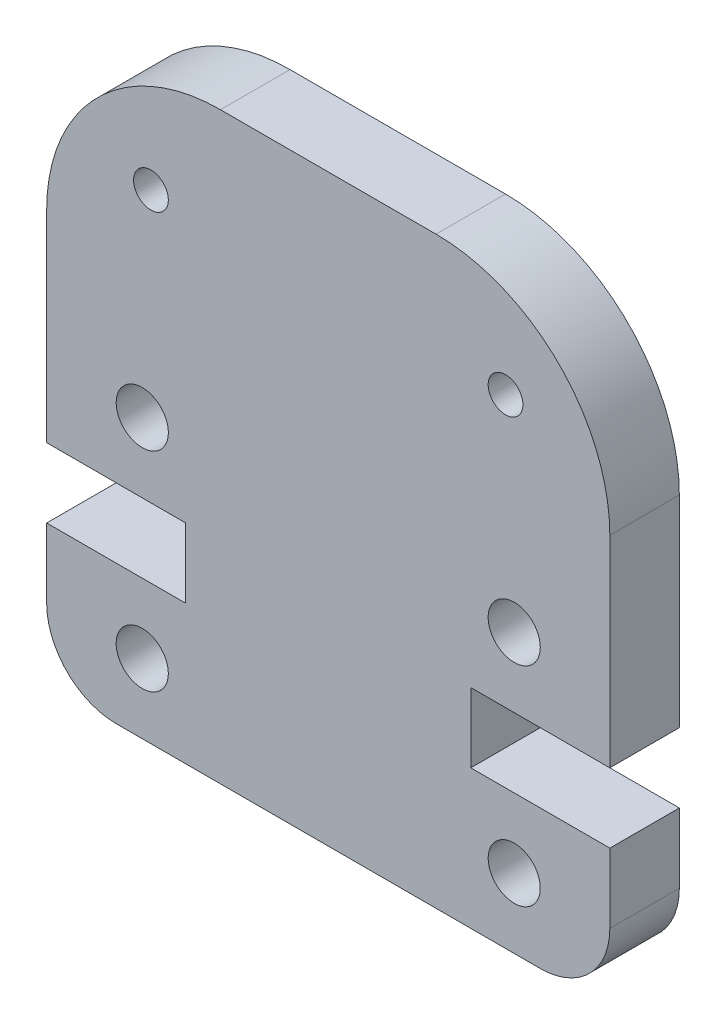
ISO-10303-21;
HEADER;
FILE_DESCRIPTION(('STEP AP214'),'2;1');
FILE_NAME('part.step','',(''),(''),'','','');
FILE_SCHEMA(('AUTOMOTIVE_DESIGN { 1 0 10303 214 1 1 1 1 }'));
ENDSEC;
DATA;
#1=APPLICATION_CONTEXT('core data for automotive mechanical design processes');
#2=APPLICATION_PROTOCOL_DEFINITION('international standard','automotive_design',2000,#1);
#3=PRODUCT_CONTEXT('',#1,'mechanical');
#4=PRODUCT('Part','Part','',(#3));
#5=PRODUCT_RELATED_PRODUCT_CATEGORY('part','',(#4));
#6=PRODUCT_DEFINITION_FORMATION('','',#4);
#7=PRODUCT_DEFINITION_CONTEXT('part definition',#1,'design');
#8=PRODUCT_DEFINITION('design','',#6,#7);
#9=PRODUCT_DEFINITION_SHAPE('','',#8);
#10=(LENGTH_UNIT() NAMED_UNIT(*) SI_UNIT(.MILLI.,.METRE.));
#11=(NAMED_UNIT(*) PLANE_ANGLE_UNIT() SI_UNIT($,.RADIAN.));
#12=(NAMED_UNIT(*) SI_UNIT($,.STERADIAN.) SOLID_ANGLE_UNIT());
#13=UNCERTAINTY_MEASURE_WITH_UNIT(LENGTH_MEASURE(1.E-05),#10,'distance_accuracy_value','');
#14=(GEOMETRIC_REPRESENTATION_CONTEXT(3) GLOBAL_UNCERTAINTY_ASSIGNED_CONTEXT((#13)) GLOBAL_UNIT_ASSIGNED_CONTEXT((#10,
#11,#12)) REPRESENTATION_CONTEXT('',''));
#15=CARTESIAN_POINT('',(0.,0.,0.));
#16=DIRECTION('',(0.,0.,1.));
#17=DIRECTION('',(1.,0.,0.));
#18=AXIS2_PLACEMENT_3D('',#15,#16,#17);
#19=CARTESIAN_POINT('',(5.,11.795,2.));
#20=DIRECTION('',(0.,0.,1.));
#21=DIRECTION('',(1.,0.,0.));
#22=AXIS2_PLACEMENT_3D('',#19,#20,#21);
#23=PLANE('',#22);
#24=CARTESIAN_POINT('',(2.75000000000089,2.,2.));
#25=DIRECTION('',(0.,0.,1.));
#26=DIRECTION('',(1.,0.,0.));
#27=AXIS2_PLACEMENT_3D('',#24,#25,#26);
#28=CIRCLE('',#27,0.750000000000087);
#29=CARTESIAN_POINT('',(3.50000000000098,2.,2.));
#30=VERTEX_POINT('',#29);
#31=EDGE_CURVE('E352',#30,#30,#28,.T.);
#32=ORIENTED_EDGE('',*,*,#31,.F.);
#33=EDGE_LOOP('',(#32));
#34=FACE_BOUND('',#33,.T.);
#35=CARTESIAN_POINT('',(3.00000000000434,13.7949999999999,2.));
#36=DIRECTION('',(0.,0.,1.));
#37=DIRECTION('',(1.,0.,0.));
#38=AXIS2_PLACEMENT_3D('',#35,#36,#37);
#39=CIRCLE('',#38,0.499999999999945);
#40=CARTESIAN_POINT('',(3.50000000000429,13.7949999999999,2.));
#41=VERTEX_POINT('',#40);
#42=EDGE_CURVE('E364',#41,#41,#39,.T.);
#43=ORIENTED_EDGE('',*,*,#42,.F.);
#44=EDGE_LOOP('',(#43));
#45=FACE_BOUND('',#44,.T.);
#46=CARTESIAN_POINT('',(13.4499999999991,2.,2.));
#47=DIRECTION('',(0.,0.,1.));
#48=DIRECTION('',(-1.,0.,0.));
#49=AXIS2_PLACEMENT_3D('',#46,#47,#48);
#50=CIRCLE('',#49,0.750000000000882);
#51=CARTESIAN_POINT('',(12.6999999999982,2.,2.));
#52=VERTEX_POINT('',#51);
#53=EDGE_CURVE('E182',#52,#52,#50,.T.);
#54=ORIENTED_EDGE('',*,*,#53,.F.);
#55=EDGE_LOOP('',(#54));
#56=FACE_BOUND('',#55,.T.);
#57=CARTESIAN_POINT('',(5.,11.795,2.));
#58=DIRECTION('',(0.,0.,1.));
#59=DIRECTION('',(1.,0.,0.));
#60=AXIS2_PLACEMENT_3D('',#57,#58,#59);
#61=CIRCLE('',#60,5.);
#62=CARTESIAN_POINT('',(5.,16.795,2.));
#63=VERTEX_POINT('',#62);
#64=CARTESIAN_POINT('',(0.,11.795,2.));
#65=VERTEX_POINT('',#64);
#66=EDGE_CURVE('E209',#63,#65,#61,.T.);
#67=ORIENTED_EDGE('',*,*,#66,.T.);
#68=DIRECTION('',(0.,-1.,0.));
#69=VECTOR('',#68,1.);
#70=CARTESIAN_POINT('',(0.,6.00000000000001,2.));
#71=LINE('',#70,#69);
#72=CARTESIAN_POINT('',(0.,6.00000000000001,2.));
#73=VERTEX_POINT('',#72);
#74=EDGE_CURVE('E117',#65,#73,#71,.T.);
#75=ORIENTED_EDGE('',*,*,#74,.T.);
#76=DIRECTION('',(1.,0.,0.));
#77=VECTOR('',#76,1.);
#78=CARTESIAN_POINT('',(0.,6.00000000000001,2.));
#79=LINE('',#78,#77);
#80=CARTESIAN_POINT('',(4.,6.00000000000001,2.));
#81=VERTEX_POINT('',#80);
#82=EDGE_CURVE('E248',#73,#81,#79,.T.);
#83=ORIENTED_EDGE('',*,*,#82,.T.);
#84=DIRECTION('',(0.,-1.,0.));
#85=VECTOR('',#84,1.);
#86=CARTESIAN_POINT('',(4.,6.00000000000001,2.));
#87=LINE('',#86,#85);
#88=CARTESIAN_POINT('',(4.,4.,2.));
#89=VERTEX_POINT('',#88);
#90=EDGE_CURVE('E267',#81,#89,#87,.T.);
#91=ORIENTED_EDGE('',*,*,#90,.T.);
#92=DIRECTION('',(-1.,0.,0.));
#93=VECTOR('',#92,1.);
#94=CARTESIAN_POINT('',(4.,4.,2.));
#95=LINE('',#94,#93);
#96=CARTESIAN_POINT('',(0.,4.,2.));
#97=VERTEX_POINT('',#96);
#98=EDGE_CURVE('E264',#89,#97,#95,.T.);
#99=ORIENTED_EDGE('',*,*,#98,.T.);
#100=DIRECTION('',(0.,-1.,0.));
#101=VECTOR('',#100,1.);
#102=CARTESIAN_POINT('',(0.,2.,2.));
#103=LINE('',#102,#101);
#104=CARTESIAN_POINT('',(0.,2.,2.));
#105=VERTEX_POINT('',#104);
#106=EDGE_CURVE('E266',#97,#105,#103,.T.);
#107=ORIENTED_EDGE('',*,*,#106,.T.);
#108=CARTESIAN_POINT('',(2.,2.,2.));
#109=DIRECTION('',(0.,0.,1.));
#110=DIRECTION('',(1.,0.,0.));
#111=AXIS2_PLACEMENT_3D('',#108,#109,#110);
#112=CIRCLE('',#111,2.);
#113=CARTESIAN_POINT('',(2.,0.,2.));
#114=VERTEX_POINT('',#113);
#115=EDGE_CURVE('E269',#105,#114,#112,.T.);
#116=ORIENTED_EDGE('',*,*,#115,.T.);
#117=DIRECTION('',(1.,0.,0.));
#118=VECTOR('',#117,1.);
#119=CARTESIAN_POINT('',(2.,0.,2.));
#120=LINE('',#119,#118);
#121=CARTESIAN_POINT('',(14.2,0.,2.));
#122=VERTEX_POINT('',#121);
#123=EDGE_CURVE('E275',#114,#122,#120,.T.);
#124=ORIENTED_EDGE('',*,*,#123,.T.);
#125=CARTESIAN_POINT('',(14.2,2.,2.));
#126=DIRECTION('',(0.,0.,1.));
#127=DIRECTION('',(-1.,0.,0.));
#128=AXIS2_PLACEMENT_3D('',#125,#126,#127);
#129=CIRCLE('',#128,2.);
#130=CARTESIAN_POINT('',(16.2,2.,2.));
#131=VERTEX_POINT('',#130);
#132=EDGE_CURVE('E277',#122,#131,#129,.T.);
#133=ORIENTED_EDGE('',*,*,#132,.T.);
#134=DIRECTION('',(0.,1.,0.));
#135=VECTOR('',#134,1.);
#136=CARTESIAN_POINT('',(16.2,2.,2.));
#137=LINE('',#136,#135);
#138=CARTESIAN_POINT('',(16.2,4.,2.));
#139=VERTEX_POINT('',#138);
#140=EDGE_CURVE('E279',#131,#139,#137,.T.);
#141=ORIENTED_EDGE('',*,*,#140,.T.);
#142=DIRECTION('',(-1.,0.,0.));
#143=VECTOR('',#142,1.);
#144=CARTESIAN_POINT('',(12.2,4.,2.));
#145=LINE('',#144,#143);
#146=CARTESIAN_POINT('',(12.2,4.,2.));
#147=VERTEX_POINT('',#146);
#148=EDGE_CURVE('E281',#139,#147,#145,.T.);
#149=ORIENTED_EDGE('',*,*,#148,.T.);
#150=DIRECTION('',(0.,1.,0.));
#151=VECTOR('',#150,1.);
#152=CARTESIAN_POINT('',(12.2,6.,2.));
#153=LINE('',#152,#151);
#154=CARTESIAN_POINT('',(12.2,6.,2.));
#155=VERTEX_POINT('',#154);
#156=EDGE_CURVE('E283',#147,#155,#153,.T.);
#157=ORIENTED_EDGE('',*,*,#156,.T.);
#158=DIRECTION('',(1.,0.,0.));
#159=VECTOR('',#158,1.);
#160=CARTESIAN_POINT('',(16.2,6.00000000000001,2.));
#161=LINE('',#160,#159);
#162=CARTESIAN_POINT('',(16.2,6.00000000000001,2.));
#163=VERTEX_POINT('',#162);
#164=EDGE_CURVE('E160',#155,#163,#161,.T.);
#165=ORIENTED_EDGE('',*,*,#164,.T.);
#166=DIRECTION('',(0.,1.,0.));
#167=VECTOR('',#166,1.);
#168=CARTESIAN_POINT('',(16.2,6.00000000000001,2.));
#169=LINE('',#168,#167);
#170=CARTESIAN_POINT('',(16.2,11.795,2.));
#171=VERTEX_POINT('',#170);
#172=EDGE_CURVE('E154',#163,#171,#169,.T.);
#173=ORIENTED_EDGE('',*,*,#172,.T.);
#174=CARTESIAN_POINT('',(11.2,11.795,2.));
#175=DIRECTION('',(0.,0.,1.));
#176=DIRECTION('',(-1.,0.,0.));
#177=AXIS2_PLACEMENT_3D('',#174,#175,#176);
#178=CIRCLE('',#177,5.);
#179=CARTESIAN_POINT('',(11.2,16.795,2.));
#180=VERTEX_POINT('',#179);
#181=EDGE_CURVE('E158',#171,#180,#178,.T.);
#182=ORIENTED_EDGE('',*,*,#181,.T.);
#183=DIRECTION('',(-1.,0.,0.));
#184=VECTOR('',#183,1.);
#185=CARTESIAN_POINT('',(5.,16.795,2.));
#186=LINE('',#185,#184);
#187=EDGE_CURVE('E50',#180,#63,#186,.T.);
#188=ORIENTED_EDGE('',*,*,#187,.T.);
#189=EDGE_LOOP('',(#67,#75,#83,#91,#99,#107,#116,#124,#133,#141,#149,#157,#165,#173,#182,#188));
#190=FACE_BOUND('',#189,.T.);
#191=CARTESIAN_POINT('',(13.4499999999991,7.99999999999954,2.));
#192=DIRECTION('',(0.,0.,1.));
#193=DIRECTION('',(1.,0.,0.));
#194=AXIS2_PLACEMENT_3D('',#191,#192,#193);
#195=CIRCLE('',#194,0.750000000000887);
#196=CARTESIAN_POINT('',(14.2,7.99999999999954,2.));
#197=VERTEX_POINT('',#196);
#198=EDGE_CURVE('E370',#197,#197,#195,.T.);
#199=ORIENTED_EDGE('',*,*,#198,.F.);
#200=EDGE_LOOP('',(#199));
#201=FACE_BOUND('',#200,.T.);
#202=CARTESIAN_POINT('',(13.1999999999957,13.7949999999999,2.));
#203=DIRECTION('',(0.,0.,1.));
#204=DIRECTION('',(-1.,0.,0.));
#205=AXIS2_PLACEMENT_3D('',#202,#203,#204);
#206=CIRCLE('',#205,0.499999999999945);
#207=CARTESIAN_POINT('',(12.6999999999957,13.7949999999999,2.));
#208=VERTEX_POINT('',#207);
#209=EDGE_CURVE('E358',#208,#208,#206,.T.);
#210=ORIENTED_EDGE('',*,*,#209,.F.);
#211=EDGE_LOOP('',(#210));
#212=FACE_BOUND('',#211,.T.);
#213=CARTESIAN_POINT('',(2.75000000000089,7.99999999999954,2.));
#214=DIRECTION('',(0.,0.,1.));
#215=DIRECTION('',(-1.,0.,0.));
#216=AXIS2_PLACEMENT_3D('',#213,#214,#215);
#217=CIRCLE('',#216,0.750000000000087);
#218=CARTESIAN_POINT('',(2.0000000000008,7.99999999999954,2.));
#219=VERTEX_POINT('',#218);
#220=EDGE_CURVE('E343',#219,#219,#217,.T.);
#221=ORIENTED_EDGE('',*,*,#220,.F.);
#222=EDGE_LOOP('',(#221));
#223=FACE_BOUND('',#222,.T.);
#224=ADVANCED_FACE('F33',(#34,#45,#56,#190,#201,#212,#223),#23,.T.);
#225=CARTESIAN_POINT('',(5.,11.795,0.));
#226=DIRECTION('',(0.,0.,1.));
#227=DIRECTION('',(1.,0.,0.));
#228=AXIS2_PLACEMENT_3D('',#225,#226,#227);
#229=PLANE('',#228);
#230=CARTESIAN_POINT('',(2.75000000000089,2.,0.));
#231=DIRECTION('',(0.,0.,1.));
#232=DIRECTION('',(1.,0.,0.));
#233=AXIS2_PLACEMENT_3D('',#230,#231,#232);
#234=CIRCLE('',#233,0.750000000000087);
#235=CARTESIAN_POINT('',(3.50000000000098,2.,0.));
#236=VERTEX_POINT('',#235);
#237=EDGE_CURVE('E349',#236,#236,#234,.T.);
#238=ORIENTED_EDGE('',*,*,#237,.T.);
#239=EDGE_LOOP('',(#238));
#240=FACE_BOUND('',#239,.T.);
#241=CARTESIAN_POINT('',(3.00000000000434,13.7949999999999,0.));
#242=DIRECTION('',(0.,0.,1.));
#243=DIRECTION('',(1.,0.,0.));
#244=AXIS2_PLACEMENT_3D('',#241,#242,#243);
#245=CIRCLE('',#244,0.499999999999945);
#246=CARTESIAN_POINT('',(3.50000000000429,13.7949999999999,0.));
#247=VERTEX_POINT('',#246);
#248=EDGE_CURVE('E361',#247,#247,#245,.T.);
#249=ORIENTED_EDGE('',*,*,#248,.T.);
#250=EDGE_LOOP('',(#249));
#251=FACE_BOUND('',#250,.T.);
#252=CARTESIAN_POINT('',(13.4499999999991,2.,0.));
#253=DIRECTION('',(0.,0.,1.));
#254=DIRECTION('',(-1.,0.,0.));
#255=AXIS2_PLACEMENT_3D('',#252,#253,#254);
#256=CIRCLE('',#255,0.750000000000882);
#257=CARTESIAN_POINT('',(12.6999999999982,2.,0.));
#258=VERTEX_POINT('',#257);
#259=EDGE_CURVE('E373',#258,#258,#256,.T.);
#260=ORIENTED_EDGE('',*,*,#259,.T.);
#261=EDGE_LOOP('',(#260));
#262=FACE_BOUND('',#261,.T.);
#263=CARTESIAN_POINT('',(5.,11.795,0.));
#264=DIRECTION('',(0.,0.,1.));
#265=DIRECTION('',(1.,0.,0.));
#266=AXIS2_PLACEMENT_3D('',#263,#264,#265);
#267=CIRCLE('',#266,5.);
#268=CARTESIAN_POINT('',(5.,16.795,0.));
#269=VERTEX_POINT('',#268);
#270=CARTESIAN_POINT('',(0.,11.795,0.));
#271=VERTEX_POINT('',#270);
#272=EDGE_CURVE('E178',#269,#271,#267,.T.);
#273=ORIENTED_EDGE('',*,*,#272,.F.);
#274=DIRECTION('',(-1.,0.,0.));
#275=VECTOR('',#274,1.);
#276=CARTESIAN_POINT('',(5.,16.795,0.));
#277=LINE('',#276,#275);
#278=CARTESIAN_POINT('',(11.2,16.795,0.));
#279=VERTEX_POINT('',#278);
#280=EDGE_CURVE('E109',#279,#269,#277,.T.);
#281=ORIENTED_EDGE('',*,*,#280,.F.);
#282=CARTESIAN_POINT('',(11.2,11.795,0.));
#283=DIRECTION('',(0.,0.,1.));
#284=DIRECTION('',(-1.,0.,0.));
#285=AXIS2_PLACEMENT_3D('',#282,#283,#284);
#286=CIRCLE('',#285,5.);
#287=CARTESIAN_POINT('',(16.2,11.795,0.));
#288=VERTEX_POINT('',#287);
#289=EDGE_CURVE('E103',#288,#279,#286,.T.);
#290=ORIENTED_EDGE('',*,*,#289,.F.);
#291=DIRECTION('',(0.,1.,0.));
#292=VECTOR('',#291,1.);
#293=CARTESIAN_POINT('',(16.2,6.00000000000001,0.));
#294=LINE('',#293,#292);
#295=CARTESIAN_POINT('',(16.2,6.00000000000001,0.));
#296=VERTEX_POINT('',#295);
#297=EDGE_CURVE('E168',#296,#288,#294,.T.);
#298=ORIENTED_EDGE('',*,*,#297,.F.);
#299=DIRECTION('',(1.,0.,0.));
#300=VECTOR('',#299,1.);
#301=CARTESIAN_POINT('',(16.2,6.00000000000001,0.));
#302=LINE('',#301,#300);
#303=CARTESIAN_POINT('',(12.2,6.,0.));
#304=VERTEX_POINT('',#303);
#305=EDGE_CURVE('E204',#304,#296,#302,.T.);
#306=ORIENTED_EDGE('',*,*,#305,.F.);
#307=DIRECTION('',(0.,1.,0.));
#308=VECTOR('',#307,1.);
#309=CARTESIAN_POINT('',(12.2,6.,0.));
#310=LINE('',#309,#308);
#311=CARTESIAN_POINT('',(12.2,4.,0.));
#312=VERTEX_POINT('',#311);
#313=EDGE_CURVE('E202',#312,#304,#310,.T.);
#314=ORIENTED_EDGE('',*,*,#313,.F.);
#315=DIRECTION('',(-1.,0.,0.));
#316=VECTOR('',#315,1.);
#317=CARTESIAN_POINT('',(12.2,4.,0.));
#318=LINE('',#317,#316);
#319=CARTESIAN_POINT('',(16.2,4.,0.));
#320=VERTEX_POINT('',#319);
#321=EDGE_CURVE('E200',#320,#312,#318,.T.);
#322=ORIENTED_EDGE('',*,*,#321,.F.);
#323=DIRECTION('',(0.,1.,0.));
#324=VECTOR('',#323,1.);
#325=CARTESIAN_POINT('',(16.2,2.,0.));
#326=LINE('',#325,#324);
#327=CARTESIAN_POINT('',(16.2,2.,0.));
#328=VERTEX_POINT('',#327);
#329=EDGE_CURVE('E198',#328,#320,#326,.T.);
#330=ORIENTED_EDGE('',*,*,#329,.F.);
#331=CARTESIAN_POINT('',(14.2,2.,0.));
#332=DIRECTION('',(0.,0.,1.));
#333=DIRECTION('',(-1.,0.,0.));
#334=AXIS2_PLACEMENT_3D('',#331,#332,#333);
#335=CIRCLE('',#334,2.);
#336=CARTESIAN_POINT('',(14.2,0.,0.));
#337=VERTEX_POINT('',#336);
#338=EDGE_CURVE('E196',#337,#328,#335,.T.);
#339=ORIENTED_EDGE('',*,*,#338,.F.);
#340=DIRECTION('',(1.,0.,0.));
#341=VECTOR('',#340,1.);
#342=CARTESIAN_POINT('',(2.,0.,0.));
#343=LINE('',#342,#341);
#344=CARTESIAN_POINT('',(2.,0.,0.));
#345=VERTEX_POINT('',#344);
#346=EDGE_CURVE('E194',#345,#337,#343,.T.);
#347=ORIENTED_EDGE('',*,*,#346,.F.);
#348=CARTESIAN_POINT('',(2.,2.,0.));
#349=DIRECTION('',(0.,0.,1.));
#350=DIRECTION('',(1.,0.,0.));
#351=AXIS2_PLACEMENT_3D('',#348,#349,#350);
#352=CIRCLE('',#351,2.);
#353=CARTESIAN_POINT('',(0.,2.,0.));
#354=VERTEX_POINT('',#353);
#355=EDGE_CURVE('E192',#354,#345,#352,.T.);
#356=ORIENTED_EDGE('',*,*,#355,.F.);
#357=DIRECTION('',(0.,-1.,0.));
#358=VECTOR('',#357,1.);
#359=CARTESIAN_POINT('',(0.,2.,0.));
#360=LINE('',#359,#358);
#361=CARTESIAN_POINT('',(0.,4.,0.));
#362=VERTEX_POINT('',#361);
#363=EDGE_CURVE('E190',#362,#354,#360,.T.);
#364=ORIENTED_EDGE('',*,*,#363,.F.);
#365=DIRECTION('',(-1.,0.,0.));
#366=VECTOR('',#365,1.);
#367=CARTESIAN_POINT('',(4.,4.,0.));
#368=LINE('',#367,#366);
#369=CARTESIAN_POINT('',(4.,4.,0.));
#370=VERTEX_POINT('',#369);
#371=EDGE_CURVE('E188',#370,#362,#368,.T.);
#372=ORIENTED_EDGE('',*,*,#371,.F.);
#373=DIRECTION('',(0.,-1.,0.));
#374=VECTOR('',#373,1.);
#375=CARTESIAN_POINT('',(4.,6.00000000000001,0.));
#376=LINE('',#375,#374);
#377=CARTESIAN_POINT('',(4.,6.00000000000001,0.));
#378=VERTEX_POINT('',#377);
#379=EDGE_CURVE('E186',#378,#370,#376,.T.);
#380=ORIENTED_EDGE('',*,*,#379,.F.);
#381=DIRECTION('',(1.,0.,0.));
#382=VECTOR('',#381,1.);
#383=CARTESIAN_POINT('',(0.,6.00000000000001,0.));
#384=LINE('',#383,#382);
#385=CARTESIAN_POINT('',(0.,6.00000000000001,0.));
#386=VERTEX_POINT('',#385);
#387=EDGE_CURVE('E184',#386,#378,#384,.T.);
#388=ORIENTED_EDGE('',*,*,#387,.F.);
#389=DIRECTION('',(0.,-1.,0.));
#390=VECTOR('',#389,1.);
#391=CARTESIAN_POINT('',(0.,6.00000000000001,0.));
#392=LINE('',#391,#390);
#393=EDGE_CURVE('E181',#271,#386,#392,.T.);
#394=ORIENTED_EDGE('',*,*,#393,.F.);
#395=EDGE_LOOP('',(#273,#281,#290,#298,#306,#314,#322,#330,#339,#347,#356,#364,#372,#380,#388,#394));
#396=FACE_BOUND('',#395,.T.);
#397=CARTESIAN_POINT('',(13.4499999999991,7.99999999999954,0.));
#398=DIRECTION('',(0.,0.,1.));
#399=DIRECTION('',(1.,0.,0.));
#400=AXIS2_PLACEMENT_3D('',#397,#398,#399);
#401=CIRCLE('',#400,0.750000000000887);
#402=CARTESIAN_POINT('',(14.2,7.99999999999954,0.));
#403=VERTEX_POINT('',#402);
#404=EDGE_CURVE('E367',#403,#403,#401,.T.);
#405=ORIENTED_EDGE('',*,*,#404,.T.);
#406=EDGE_LOOP('',(#405));
#407=FACE_BOUND('',#406,.T.);
#408=CARTESIAN_POINT('',(13.1999999999957,13.7949999999999,0.));
#409=DIRECTION('',(0.,0.,1.));
#410=DIRECTION('',(-1.,0.,0.));
#411=AXIS2_PLACEMENT_3D('',#408,#409,#410);
#412=CIRCLE('',#411,0.499999999999945);
#413=CARTESIAN_POINT('',(12.6999999999957,13.7949999999999,0.));
#414=VERTEX_POINT('',#413);
#415=EDGE_CURVE('E355',#414,#414,#412,.T.);
#416=ORIENTED_EDGE('',*,*,#415,.T.);
#417=EDGE_LOOP('',(#416));
#418=FACE_BOUND('',#417,.T.);
#419=CARTESIAN_POINT('',(2.75000000000089,7.99999999999954,0.));
#420=DIRECTION('',(0.,0.,1.));
#421=DIRECTION('',(-1.,0.,0.));
#422=AXIS2_PLACEMENT_3D('',#419,#420,#421);
#423=CIRCLE('',#422,0.750000000000087);
#424=CARTESIAN_POINT('',(2.0000000000008,7.99999999999954,0.));
#425=VERTEX_POINT('',#424);
#426=EDGE_CURVE('E346',#425,#425,#423,.T.);
#427=ORIENTED_EDGE('',*,*,#426,.T.);
#428=EDGE_LOOP('',(#427));
#429=FACE_BOUND('',#428,.T.);
#430=ADVANCED_FACE('F252',(#240,#251,#262,#396,#407,#418,#429),#229,.F.);
#431=CARTESIAN_POINT('',(5.,11.795,2.));
#432=DIRECTION('',(0.,0.,-1.));
#433=DIRECTION('',(-1.,0.,0.));
#434=AXIS2_PLACEMENT_3D('',#431,#432,#433);
#435=CYLINDRICAL_SURFACE('',#434,5.);
#436=ORIENTED_EDGE('',*,*,#272,.T.);
#437=DIRECTION('',(0.,0.,-1.));
#438=VECTOR('',#437,1.);
#439=CARTESIAN_POINT('',(0.,11.795,2.));
#440=LINE('',#439,#438);
#441=EDGE_CURVE('E11',#65,#271,#440,.T.);
#442=ORIENTED_EDGE('',*,*,#441,.F.);
#443=ORIENTED_EDGE('',*,*,#66,.F.);
#444=DIRECTION('',(0.,0.,-1.));
#445=VECTOR('',#444,1.);
#446=CARTESIAN_POINT('',(5.,16.795,2.));
#447=LINE('',#446,#445);
#448=EDGE_CURVE('E174',#63,#269,#447,.T.);
#449=ORIENTED_EDGE('',*,*,#448,.T.);
#450=EDGE_LOOP('',(#436,#442,#443,#449));
#451=FACE_BOUND('',#450,.T.);
#452=ADVANCED_FACE('F35',(#451),#435,.T.);
#453=CARTESIAN_POINT('',(0.,6.00000000000001,2.));
#454=DIRECTION('',(1.,0.,0.));
#455=DIRECTION('',(0.,0.,-1.));
#456=AXIS2_PLACEMENT_3D('',#453,#454,#455);
#457=PLANE('',#456);
#458=ORIENTED_EDGE('',*,*,#393,.T.);
#459=DIRECTION('',(0.,0.,-1.));
#460=VECTOR('',#459,1.);
#461=CARTESIAN_POINT('',(0.,6.00000000000001,2.));
#462=LINE('',#461,#460);
#463=EDGE_CURVE('E42',#73,#386,#462,.T.);
#464=ORIENTED_EDGE('',*,*,#463,.F.);
#465=ORIENTED_EDGE('',*,*,#74,.F.);
#466=ORIENTED_EDGE('',*,*,#441,.T.);
#467=EDGE_LOOP('',(#458,#464,#465,#466));
#468=FACE_BOUND('',#467,.T.);
#469=ADVANCED_FACE('F540',(#468),#457,.F.);
#470=CARTESIAN_POINT('',(0.,6.00000000000001,2.));
#471=DIRECTION('',(0.,1.,0.));
#472=DIRECTION('',(0.,0.,1.));
#473=AXIS2_PLACEMENT_3D('',#470,#471,#472);
#474=PLANE('',#473);
#475=ORIENTED_EDGE('',*,*,#387,.T.);
#476=DIRECTION('',(0.,0.,-1.));
#477=VECTOR('',#476,1.);
#478=CARTESIAN_POINT('',(4.,6.00000000000001,2.));
#479=LINE('',#478,#477);
#480=EDGE_CURVE('E240',#81,#378,#479,.T.);
#481=ORIENTED_EDGE('',*,*,#480,.F.);
#482=ORIENTED_EDGE('',*,*,#82,.F.);
#483=ORIENTED_EDGE('',*,*,#463,.T.);
#484=EDGE_LOOP('',(#475,#481,#482,#483));
#485=FACE_BOUND('',#484,.T.);
#486=ADVANCED_FACE('F246',(#485),#474,.F.);
#487=CARTESIAN_POINT('',(4.,6.00000000000001,2.));
#488=DIRECTION('',(1.,0.,0.));
#489=DIRECTION('',(0.,0.,-1.));
#490=AXIS2_PLACEMENT_3D('',#487,#488,#489);
#491=PLANE('',#490);
#492=ORIENTED_EDGE('',*,*,#379,.T.);
#493=DIRECTION('',(0.,0.,-1.));
#494=VECTOR('',#493,1.);
#495=CARTESIAN_POINT('',(4.,4.,2.));
#496=LINE('',#495,#494);
#497=EDGE_CURVE('E237',#89,#370,#496,.T.);
#498=ORIENTED_EDGE('',*,*,#497,.F.);
#499=ORIENTED_EDGE('',*,*,#90,.F.);
#500=ORIENTED_EDGE('',*,*,#480,.T.);
#501=EDGE_LOOP('',(#492,#498,#499,#500));
#502=FACE_BOUND('',#501,.T.);
#503=ADVANCED_FACE('F258',(#502),#491,.F.);
#504=CARTESIAN_POINT('',(4.,4.,2.));
#505=DIRECTION('',(0.,-1.,0.));
#506=DIRECTION('',(0.,0.,-1.));
#507=AXIS2_PLACEMENT_3D('',#504,#505,#506);
#508=PLANE('',#507);
#509=ORIENTED_EDGE('',*,*,#371,.T.);
#510=DIRECTION('',(0.,0.,-1.));
#511=VECTOR('',#510,1.);
#512=CARTESIAN_POINT('',(0.,4.,2.));
#513=LINE('',#512,#511);
#514=EDGE_CURVE('E234',#97,#362,#513,.T.);
#515=ORIENTED_EDGE('',*,*,#514,.F.);
#516=ORIENTED_EDGE('',*,*,#98,.F.);
#517=ORIENTED_EDGE('',*,*,#497,.T.);
#518=EDGE_LOOP('',(#509,#515,#516,#517));
#519=FACE_BOUND('',#518,.T.);
#520=ADVANCED_FACE('F262',(#519),#508,.F.);
#521=CARTESIAN_POINT('',(0.,2.,2.));
#522=DIRECTION('',(1.,0.,0.));
#523=DIRECTION('',(0.,0.,-1.));
#524=AXIS2_PLACEMENT_3D('',#521,#522,#523);
#525=PLANE('',#524);
#526=ORIENTED_EDGE('',*,*,#363,.T.);
#527=DIRECTION('',(0.,0.,-1.));
#528=VECTOR('',#527,1.);
#529=CARTESIAN_POINT('',(0.,2.,2.));
#530=LINE('',#529,#528);
#531=EDGE_CURVE('E231',#105,#354,#530,.T.);
#532=ORIENTED_EDGE('',*,*,#531,.F.);
#533=ORIENTED_EDGE('',*,*,#106,.F.);
#534=ORIENTED_EDGE('',*,*,#514,.T.);
#535=EDGE_LOOP('',(#526,#532,#533,#534));
#536=FACE_BOUND('',#535,.T.);
#537=ADVANCED_FACE('F505',(#536),#525,.F.);
#538=CARTESIAN_POINT('',(2.,2.,2.));
#539=DIRECTION('',(0.,0.,-1.));
#540=DIRECTION('',(-1.,0.,0.));
#541=AXIS2_PLACEMENT_3D('',#538,#539,#540);
#542=CYLINDRICAL_SURFACE('',#541,2.);
#543=ORIENTED_EDGE('',*,*,#355,.T.);
#544=DIRECTION('',(0.,0.,-1.));
#545=VECTOR('',#544,1.);
#546=CARTESIAN_POINT('',(2.,0.,2.));
#547=LINE('',#546,#545);
#548=EDGE_CURVE('E228',#114,#345,#547,.T.);
#549=ORIENTED_EDGE('',*,*,#548,.F.);
#550=ORIENTED_EDGE('',*,*,#115,.F.);
#551=ORIENTED_EDGE('',*,*,#531,.T.);
#552=EDGE_LOOP('',(#543,#549,#550,#551));
#553=FACE_BOUND('',#552,.T.);
#554=ADVANCED_FACE('F495',(#553),#542,.T.);
#555=CARTESIAN_POINT('',(2.,0.,2.));
#556=DIRECTION('',(0.,1.,0.));
#557=DIRECTION('',(-1.,0.,0.));
#558=AXIS2_PLACEMENT_3D('',#555,#556,#557);
#559=PLANE('',#558);
#560=ORIENTED_EDGE('',*,*,#346,.T.);
#561=DIRECTION('',(0.,0.,-1.));
#562=VECTOR('',#561,1.);
#563=CARTESIAN_POINT('',(14.2,0.,2.));
#564=LINE('',#563,#562);
#565=EDGE_CURVE('E225',#122,#337,#564,.T.);
#566=ORIENTED_EDGE('',*,*,#565,.F.);
#567=ORIENTED_EDGE('',*,*,#123,.F.);
#568=ORIENTED_EDGE('',*,*,#548,.T.);
#569=EDGE_LOOP('',(#560,#566,#567,#568));
#570=FACE_BOUND('',#569,.T.);
#571=ADVANCED_FACE('F485',(#570),#559,.F.);
#572=CARTESIAN_POINT('',(14.2,2.,2.));
#573=DIRECTION('',(0.,0.,-1.));
#574=DIRECTION('',(-1.,0.,0.));
#575=AXIS2_PLACEMENT_3D('',#572,#573,#574);
#576=CYLINDRICAL_SURFACE('',#575,2.);
#577=ORIENTED_EDGE('',*,*,#338,.T.);
#578=DIRECTION('',(0.,0.,-1.));
#579=VECTOR('',#578,1.);
#580=CARTESIAN_POINT('',(16.2,2.,2.));
#581=LINE('',#580,#579);
#582=EDGE_CURVE('E222',#131,#328,#581,.T.);
#583=ORIENTED_EDGE('',*,*,#582,.F.);
#584=ORIENTED_EDGE('',*,*,#132,.F.);
#585=ORIENTED_EDGE('',*,*,#565,.T.);
#586=EDGE_LOOP('',(#577,#583,#584,#585));
#587=FACE_BOUND('',#586,.T.);
#588=ADVANCED_FACE('F475',(#587),#576,.T.);
#589=CARTESIAN_POINT('',(16.2,2.,2.));
#590=DIRECTION('',(-1.,0.,0.));
#591=DIRECTION('',(0.,0.,1.));
#592=AXIS2_PLACEMENT_3D('',#589,#590,#591);
#593=PLANE('',#592);
#594=ORIENTED_EDGE('',*,*,#329,.T.);
#595=DIRECTION('',(0.,0.,-1.));
#596=VECTOR('',#595,1.);
#597=CARTESIAN_POINT('',(16.2,4.,2.));
#598=LINE('',#597,#596);
#599=EDGE_CURVE('E219',#139,#320,#598,.T.);
#600=ORIENTED_EDGE('',*,*,#599,.F.);
#601=ORIENTED_EDGE('',*,*,#140,.F.);
#602=ORIENTED_EDGE('',*,*,#582,.T.);
#603=EDGE_LOOP('',(#594,#600,#601,#602));
#604=FACE_BOUND('',#603,.T.);
#605=ADVANCED_FACE('F465',(#604),#593,.F.);
#606=CARTESIAN_POINT('',(12.2,4.,2.));
#607=DIRECTION('',(0.,-1.,0.));
#608=DIRECTION('',(1.,0.,0.));
#609=AXIS2_PLACEMENT_3D('',#606,#607,#608);
#610=PLANE('',#609);
#611=ORIENTED_EDGE('',*,*,#321,.T.);
#612=DIRECTION('',(0.,0.,-1.));
#613=VECTOR('',#612,1.);
#614=CARTESIAN_POINT('',(12.2,4.,2.));
#615=LINE('',#614,#613);
#616=EDGE_CURVE('E216',#147,#312,#615,.T.);
#617=ORIENTED_EDGE('',*,*,#616,.F.);
#618=ORIENTED_EDGE('',*,*,#148,.F.);
#619=ORIENTED_EDGE('',*,*,#599,.T.);
#620=EDGE_LOOP('',(#611,#617,#618,#619));
#621=FACE_BOUND('',#620,.T.);
#622=ADVANCED_FACE('F456',(#621),#610,.F.);
#623=CARTESIAN_POINT('',(12.2,6.,2.));
#624=DIRECTION('',(-1.,0.,0.));
#625=DIRECTION('',(0.,0.,1.));
#626=AXIS2_PLACEMENT_3D('',#623,#624,#625);
#627=PLANE('',#626);
#628=ORIENTED_EDGE('',*,*,#313,.T.);
#629=DIRECTION('',(0.,0.,-1.));
#630=VECTOR('',#629,1.);
#631=CARTESIAN_POINT('',(12.2,6.,2.));
#632=LINE('',#631,#630);
#633=EDGE_CURVE('E213',#155,#304,#632,.T.);
#634=ORIENTED_EDGE('',*,*,#633,.F.);
#635=ORIENTED_EDGE('',*,*,#156,.F.);
#636=ORIENTED_EDGE('',*,*,#616,.T.);
#637=EDGE_LOOP('',(#628,#634,#635,#636));
#638=FACE_BOUND('',#637,.T.);
#639=ADVANCED_FACE('F289',(#638),#627,.F.);
#640=CARTESIAN_POINT('',(16.2,6.00000000000001,2.));
#641=DIRECTION('',(0.,1.,0.));
#642=DIRECTION('',(-1.,0.,0.));
#643=AXIS2_PLACEMENT_3D('',#640,#641,#642);
#644=PLANE('',#643);
#645=ORIENTED_EDGE('',*,*,#305,.T.);
#646=DIRECTION('',(0.,0.,-1.));
#647=VECTOR('',#646,1.);
#648=CARTESIAN_POINT('',(16.2,6.00000000000001,2.));
#649=LINE('',#648,#647);
#650=EDGE_CURVE('E169',#163,#296,#649,.T.);
#651=ORIENTED_EDGE('',*,*,#650,.F.);
#652=ORIENTED_EDGE('',*,*,#164,.F.);
#653=ORIENTED_EDGE('',*,*,#633,.T.);
#654=EDGE_LOOP('',(#645,#651,#652,#653));
#655=FACE_BOUND('',#654,.T.);
#656=ADVANCED_FACE('F293',(#655),#644,.F.);
#657=CARTESIAN_POINT('',(16.2,6.00000000000001,2.));
#658=DIRECTION('',(-1.,0.,0.));
#659=DIRECTION('',(0.,-1.,0.));
#660=AXIS2_PLACEMENT_3D('',#657,#658,#659);
#661=PLANE('',#660);
#662=ORIENTED_EDGE('',*,*,#297,.T.);
#663=DIRECTION('',(0.,0.,-1.));
#664=VECTOR('',#663,1.);
#665=CARTESIAN_POINT('',(16.2,11.795,2.));
#666=LINE('',#665,#664);
#667=EDGE_CURVE('E165',#171,#288,#666,.T.);
#668=ORIENTED_EDGE('',*,*,#667,.F.);
#669=ORIENTED_EDGE('',*,*,#172,.F.);
#670=ORIENTED_EDGE('',*,*,#650,.T.);
#671=EDGE_LOOP('',(#662,#668,#669,#670));
#672=FACE_BOUND('',#671,.T.);
#673=ADVANCED_FACE('F166',(#672),#661,.F.);
#674=CARTESIAN_POINT('',(11.2,11.795,2.));
#675=DIRECTION('',(0.,0.,-1.));
#676=DIRECTION('',(-1.,0.,0.));
#677=AXIS2_PLACEMENT_3D('',#674,#675,#676);
#678=CYLINDRICAL_SURFACE('',#677,5.);
#679=ORIENTED_EDGE('',*,*,#289,.T.);
#680=DIRECTION('',(0.,0.,-1.));
#681=VECTOR('',#680,1.);
#682=CARTESIAN_POINT('',(11.2,16.795,2.));
#683=LINE('',#682,#681);
#684=EDGE_CURVE('E170',#180,#279,#683,.T.);
#685=ORIENTED_EDGE('',*,*,#684,.F.);
#686=ORIENTED_EDGE('',*,*,#181,.F.);
#687=ORIENTED_EDGE('',*,*,#667,.T.);
#688=EDGE_LOOP('',(#679,#685,#686,#687));
#689=FACE_BOUND('',#688,.T.);
#690=ADVANCED_FACE('F172',(#689),#678,.T.);
#691=CARTESIAN_POINT('',(5.,16.795,2.));
#692=DIRECTION('',(0.,-1.,0.));
#693=DIRECTION('',(0.,0.,-1.));
#694=AXIS2_PLACEMENT_3D('',#691,#692,#693);
#695=PLANE('',#694);
#696=ORIENTED_EDGE('',*,*,#280,.T.);
#697=ORIENTED_EDGE('',*,*,#448,.F.);
#698=ORIENTED_EDGE('',*,*,#187,.F.);
#699=ORIENTED_EDGE('',*,*,#684,.T.);
#700=EDGE_LOOP('',(#696,#697,#698,#699));
#701=FACE_BOUND('',#700,.T.);
#702=ADVANCED_FACE('F297',(#701),#695,.F.);
#703=CARTESIAN_POINT('',(13.4499999999991,2.,2.));
#704=DIRECTION('',(0.,0.,-1.));
#705=DIRECTION('',(-1.,0.,0.));
#706=AXIS2_PLACEMENT_3D('',#703,#704,#705);
#707=CYLINDRICAL_SURFACE('',#706,0.750000000000882);
#708=ORIENTED_EDGE('',*,*,#53,.T.);
#709=EDGE_LOOP('',(#708));
#710=FACE_BOUND('',#709,.T.);
#711=ORIENTED_EDGE('',*,*,#259,.F.);
#712=EDGE_LOOP('',(#711));
#713=FACE_BOUND('',#712,.T.);
#714=ADVANCED_FACE('F299',(#710,#713),#707,.F.);
#715=CARTESIAN_POINT('',(13.4499999999991,7.99999999999954,2.));
#716=DIRECTION('',(0.,0.,-1.));
#717=DIRECTION('',(-1.,0.,0.));
#718=AXIS2_PLACEMENT_3D('',#715,#716,#717);
#719=CYLINDRICAL_SURFACE('',#718,0.750000000000887);
#720=ORIENTED_EDGE('',*,*,#198,.T.);
#721=EDGE_LOOP('',(#720));
#722=FACE_BOUND('',#721,.T.);
#723=ORIENTED_EDGE('',*,*,#404,.F.);
#724=EDGE_LOOP('',(#723));
#725=FACE_BOUND('',#724,.T.);
#726=ADVANCED_FACE('F305',(#722,#725),#719,.F.);
#727=CARTESIAN_POINT('',(3.00000000000434,13.7949999999999,2.));
#728=DIRECTION('',(0.,0.,-1.));
#729=DIRECTION('',(-1.,0.,0.));
#730=AXIS2_PLACEMENT_3D('',#727,#728,#729);
#731=CYLINDRICAL_SURFACE('',#730,0.499999999999945);
#732=ORIENTED_EDGE('',*,*,#42,.T.);
#733=EDGE_LOOP('',(#732));
#734=FACE_BOUND('',#733,.T.);
#735=ORIENTED_EDGE('',*,*,#248,.F.);
#736=EDGE_LOOP('',(#735));
#737=FACE_BOUND('',#736,.T.);
#738=ADVANCED_FACE('F322',(#734,#737),#731,.F.);
#739=CARTESIAN_POINT('',(13.1999999999957,13.7949999999999,2.));
#740=DIRECTION('',(0.,0.,-1.));
#741=DIRECTION('',(-1.,0.,0.));
#742=AXIS2_PLACEMENT_3D('',#739,#740,#741);
#743=CYLINDRICAL_SURFACE('',#742,0.499999999999945);
#744=ORIENTED_EDGE('',*,*,#209,.T.);
#745=EDGE_LOOP('',(#744));
#746=FACE_BOUND('',#745,.T.);
#747=ORIENTED_EDGE('',*,*,#415,.F.);
#748=EDGE_LOOP('',(#747));
#749=FACE_BOUND('',#748,.T.);
#750=ADVANCED_FACE('F326',(#746,#749),#743,.F.);
#751=CARTESIAN_POINT('',(2.75000000000089,2.,2.));
#752=DIRECTION('',(0.,0.,-1.));
#753=DIRECTION('',(-1.,0.,0.));
#754=AXIS2_PLACEMENT_3D('',#751,#752,#753);
#755=CYLINDRICAL_SURFACE('',#754,0.750000000000087);
#756=ORIENTED_EDGE('',*,*,#31,.T.);
#757=EDGE_LOOP('',(#756));
#758=FACE_BOUND('',#757,.T.);
#759=ORIENTED_EDGE('',*,*,#237,.F.);
#760=EDGE_LOOP('',(#759));
#761=FACE_BOUND('',#760,.T.);
#762=ADVANCED_FACE('F330',(#758,#761),#755,.F.);
#763=CARTESIAN_POINT('',(2.75000000000089,7.99999999999954,2.));
#764=DIRECTION('',(0.,0.,-1.));
#765=DIRECTION('',(-1.,0.,0.));
#766=AXIS2_PLACEMENT_3D('',#763,#764,#765);
#767=CYLINDRICAL_SURFACE('',#766,0.750000000000087);
#768=ORIENTED_EDGE('',*,*,#220,.T.);
#769=EDGE_LOOP('',(#768));
#770=FACE_BOUND('',#769,.T.);
#771=ORIENTED_EDGE('',*,*,#426,.F.);
#772=EDGE_LOOP('',(#771));
#773=FACE_BOUND('',#772,.T.);
#774=ADVANCED_FACE('F334',(#770,#773),#767,.F.);
#775=CLOSED_SHELL('',(#224,#430,#452,#469,#486,#503,#520,#537,#554,#571,#588,#605,#622,#639,
#656,#673,#690,#702,#714,#726,#738,#750,#762,#774));
#776=MANIFOLD_SOLID_BREP('B2',#775);
#777=ADVANCED_BREP_SHAPE_REPRESENTATION('',(#18,#776),#14);
#778=SHAPE_DEFINITION_REPRESENTATION(#9,#777);
ENDSEC;
END-ISO-10303-21;
